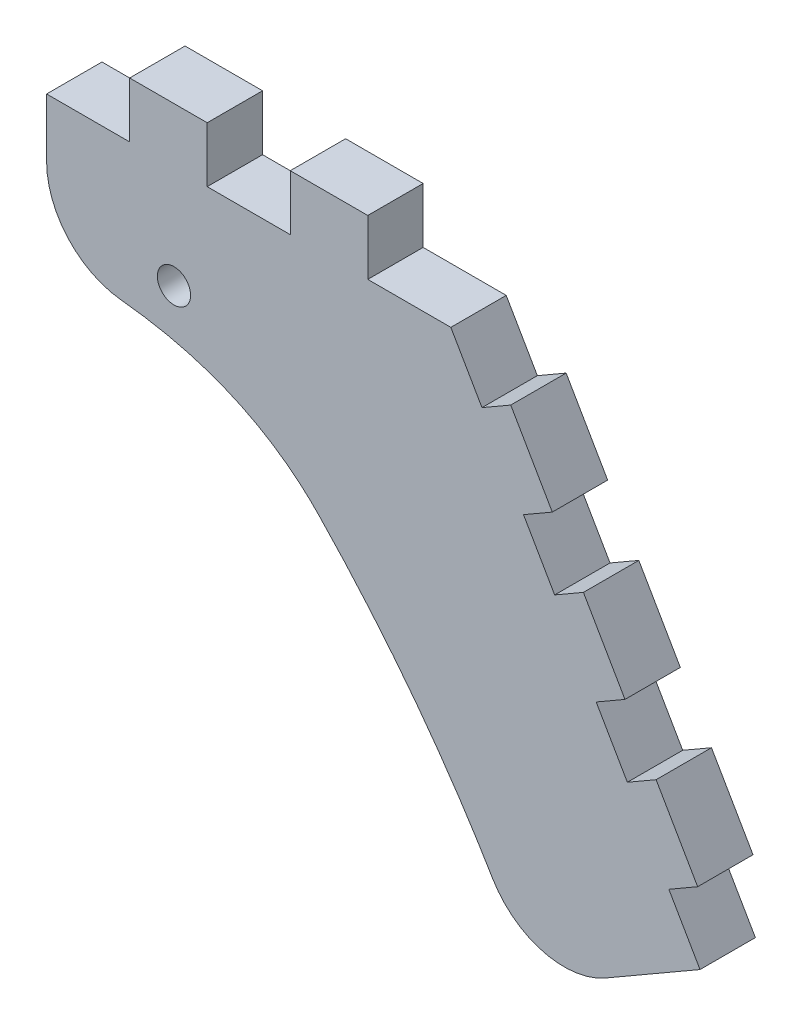
ISO-10303-21;
HEADER;
FILE_DESCRIPTION(('STEP AP214'),'2;1');
FILE_NAME('part.step','',(''),(''),'','','');
FILE_SCHEMA(('AUTOMOTIVE_DESIGN { 1 0 10303 214 1 1 1 1 }'));
ENDSEC;
DATA;
#1=APPLICATION_CONTEXT('core data for automotive mechanical design processes');
#2=APPLICATION_PROTOCOL_DEFINITION('international standard','automotive_design',2000,#1);
#3=PRODUCT_CONTEXT('',#1,'mechanical');
#4=PRODUCT('Part','Part','',(#3));
#5=PRODUCT_RELATED_PRODUCT_CATEGORY('part','',(#4));
#6=PRODUCT_DEFINITION_FORMATION('','',#4);
#7=PRODUCT_DEFINITION_CONTEXT('part definition',#1,'design');
#8=PRODUCT_DEFINITION('design','',#6,#7);
#9=PRODUCT_DEFINITION_SHAPE('','',#8);
#10=(LENGTH_UNIT() NAMED_UNIT(*) SI_UNIT(.MILLI.,.METRE.));
#11=(NAMED_UNIT(*) PLANE_ANGLE_UNIT() SI_UNIT($,.RADIAN.));
#12=(NAMED_UNIT(*) SI_UNIT($,.STERADIAN.) SOLID_ANGLE_UNIT());
#13=UNCERTAINTY_MEASURE_WITH_UNIT(LENGTH_MEASURE(1.E-05),#10,'distance_accuracy_value','');
#14=(GEOMETRIC_REPRESENTATION_CONTEXT(3) GLOBAL_UNCERTAINTY_ASSIGNED_CONTEXT((#13)) GLOBAL_UNIT_ASSIGNED_CONTEXT((#10,
#11,#12)) REPRESENTATION_CONTEXT('',''));
#15=CARTESIAN_POINT('',(0.,0.,0.));
#16=DIRECTION('',(0.,0.,1.));
#17=DIRECTION('',(1.,0.,0.));
#18=AXIS2_PLACEMENT_3D('',#15,#16,#17);
#19=CARTESIAN_POINT('',(26.0735053970116,-27.8403706532565,10.));
#20=DIRECTION('',(0.,0.,1.));
#21=DIRECTION('',(1.,0.,0.));
#22=AXIS2_PLACEMENT_3D('',#19,#20,#21);
#23=PLANE('',#22);
#24=CARTESIAN_POINT('',(49.1604769860692,-41.2912650883353,10.));
#25=CARTESIAN_POINT('',(64.8173033808278,-57.5696768542522,10.));
#26=CARTESIAN_POINT('',(77.6601813413193,-75.6200172716737,10.));
#27=CARTESIAN_POINT('',(87.6891108675446,-95.4422863405995,10.));
#28=B_SPLINE_CURVE_WITH_KNOTS('',3,(#24,#25,#26,#27),.UNSPECIFIED.,.F.,.F.,(4,4),(0.,1.),.UNSPECIFIED.);
#29=CARTESIAN_POINT('',(49.1604769860692,-41.2912650883353,10.));
#30=VERTEX_POINT('',#29);
#31=CARTESIAN_POINT('',(80.5569815722585,-82.440526329078,10.));
#32=VERTEX_POINT('',#31);
#33=EDGE_CURVE('E219',#30,#32,#28,.T.);
#34=ORIENTED_EDGE('',*,*,#33,.T.);
#35=CARTESIAN_POINT('',(93.4594473497084,-74.7902729436187,10.));
#36=DIRECTION('',(0.,0.,1.));
#37=DIRECTION('',(1.,0.,0.));
#38=AXIS2_PLACEMENT_3D('',#35,#36,#37);
#39=CIRCLE('',#38,15.);
#40=CARTESIAN_POINT('',(100.959447349708,-87.7806540003853,10.));
#41=VERTEX_POINT('',#40);
#42=EDGE_CURVE('E511',#32,#41,#39,.T.);
#43=ORIENTED_EDGE('',*,*,#42,.T.);
#44=DIRECTION('',(0.866025403784439,0.499999999999999,0.));
#45=VECTOR('',#44,1.);
#46=CARTESIAN_POINT('',(118.,-77.9422863405996,10.));
#47=LINE('',#46,#45);
#48=CARTESIAN_POINT('',(118.,-77.9422863405996,10.));
#49=VERTEX_POINT('',#48);
#50=EDGE_CURVE('E240',#41,#49,#47,.T.);
#51=ORIENTED_EDGE('',*,*,#50,.T.);
#52=DIRECTION('',(-0.499999999999998,0.86602540378444,0.));
#53=VECTOR('',#52,1.);
#54=CARTESIAN_POINT('',(112.375,-68.1995005480246,10.));
#55=LINE('',#54,#53);
#56=CARTESIAN_POINT('',(112.375,-68.1995005480246,10.));
#57=VERTEX_POINT('',#56);
#58=EDGE_CURVE('E242',#49,#57,#55,.T.);
#59=ORIENTED_EDGE('',*,*,#58,.T.);
#60=DIRECTION('',(0.866025403784439,0.499999999999999,0.));
#61=VECTOR('',#60,1.);
#62=CARTESIAN_POINT('',(117.571152422706,-65.1995005480249,10.));
#63=LINE('',#62,#61);
#64=CARTESIAN_POINT('',(117.571152422706,-65.1995005480249,10.));
#65=VERTEX_POINT('',#64);
#66=EDGE_CURVE('E391',#57,#65,#63,.T.);
#67=ORIENTED_EDGE('',*,*,#66,.T.);
#68=DIRECTION('',(-0.5,0.866025403784439,0.));
#69=VECTOR('',#68,1.);
#70=CARTESIAN_POINT('',(110.071152422706,-52.2091194912583,10.));
#71=LINE('',#70,#69);
#72=CARTESIAN_POINT('',(110.071152422706,-52.2091194912583,10.));
#73=VERTEX_POINT('',#72);
#74=EDGE_CURVE('E532',#65,#73,#71,.T.);
#75=ORIENTED_EDGE('',*,*,#74,.T.);
#76=DIRECTION('',(-0.866025403784439,-0.499999999999999,0.));
#77=VECTOR('',#76,1.);
#78=CARTESIAN_POINT('',(104.875,-55.209119491258,10.));
#79=LINE('',#78,#77);
#80=CARTESIAN_POINT('',(104.875,-55.209119491258,10.));
#81=VERTEX_POINT('',#80);
#82=EDGE_CURVE('E536',#73,#81,#79,.T.);
#83=ORIENTED_EDGE('',*,*,#82,.T.);
#84=DIRECTION('',(-0.499999999999999,0.866025403784439,0.));
#85=VECTOR('',#84,1.);
#86=CARTESIAN_POINT('',(99.2499999999999,-45.4663336986831,10.));
#87=LINE('',#86,#85);
#88=CARTESIAN_POINT('',(99.2499999999999,-45.4663336986831,10.));
#89=VERTEX_POINT('',#88);
#90=EDGE_CURVE('E538',#81,#89,#87,.T.);
#91=ORIENTED_EDGE('',*,*,#90,.T.);
#92=DIRECTION('',(0.86602540378444,0.499999999999998,0.));
#93=VECTOR('',#92,1.);
#94=CARTESIAN_POINT('',(104.446152422706,-42.4663336986834,10.));
#95=LINE('',#94,#93);
#96=CARTESIAN_POINT('',(104.446152422706,-42.4663336986834,10.));
#97=VERTEX_POINT('',#96);
#98=EDGE_CURVE('E540',#89,#97,#95,.T.);
#99=ORIENTED_EDGE('',*,*,#98,.T.);
#100=DIRECTION('',(-0.5,0.866025403784439,0.));
#101=VECTOR('',#100,1.);
#102=CARTESIAN_POINT('',(96.946152422706,-29.4759526419168,10.));
#103=LINE('',#102,#101);
#104=CARTESIAN_POINT('',(96.946152422706,-29.4759526419168,10.));
#105=VERTEX_POINT('',#104);
#106=EDGE_CURVE('E542',#97,#105,#103,.T.);
#107=ORIENTED_EDGE('',*,*,#106,.T.);
#108=DIRECTION('',(-0.866025403784439,-0.499999999999998,0.));
#109=VECTOR('',#108,1.);
#110=CARTESIAN_POINT('',(91.7499999999999,-32.4759526419165,10.));
#111=LINE('',#110,#109);
#112=CARTESIAN_POINT('',(91.7499999999999,-32.4759526419165,10.));
#113=VERTEX_POINT('',#112);
#114=EDGE_CURVE('E544',#105,#113,#111,.T.);
#115=ORIENTED_EDGE('',*,*,#114,.T.);
#116=DIRECTION('',(-0.499999999999999,0.866025403784439,0.));
#117=VECTOR('',#116,1.);
#118=CARTESIAN_POINT('',(86.125,-22.7331668493415,10.));
#119=LINE('',#118,#117);
#120=CARTESIAN_POINT('',(86.125,-22.7331668493415,10.));
#121=VERTEX_POINT('',#120);
#122=EDGE_CURVE('E546',#113,#121,#119,.T.);
#123=ORIENTED_EDGE('',*,*,#122,.T.);
#124=DIRECTION('',(0.866025403784439,0.5,0.));
#125=VECTOR('',#124,1.);
#126=CARTESIAN_POINT('',(91.321152422706,-19.7331668493419,10.));
#127=LINE('',#126,#125);
#128=CARTESIAN_POINT('',(91.321152422706,-19.7331668493419,10.));
#129=VERTEX_POINT('',#128);
#130=EDGE_CURVE('E548',#121,#129,#127,.T.);
#131=ORIENTED_EDGE('',*,*,#130,.T.);
#132=DIRECTION('',(-0.499999999999998,0.86602540378444,0.));
#133=VECTOR('',#132,1.);
#134=CARTESIAN_POINT('',(83.821152422706,-6.74278579257528,10.));
#135=LINE('',#134,#133);
#136=CARTESIAN_POINT('',(83.821152422706,-6.74278579257528,10.));
#137=VERTEX_POINT('',#136);
#138=EDGE_CURVE('E550',#129,#137,#135,.T.);
#139=ORIENTED_EDGE('',*,*,#138,.T.);
#140=DIRECTION('',(-0.866025403784439,-0.499999999999999,0.));
#141=VECTOR('',#140,1.);
#142=CARTESIAN_POINT('',(78.625,-9.74278579257494,10.));
#143=LINE('',#142,#141);
#144=CARTESIAN_POINT('',(78.625,-9.74278579257494,10.));
#145=VERTEX_POINT('',#144);
#146=EDGE_CURVE('E552',#137,#145,#143,.T.);
#147=ORIENTED_EDGE('',*,*,#146,.T.);
#148=DIRECTION('',(-0.499999999999999,0.866025403784439,0.));
#149=VECTOR('',#148,1.);
#150=CARTESIAN_POINT('',(73.,0.,10.));
#151=LINE('',#150,#149);
#152=CARTESIAN_POINT('',(73.,0.,10.));
#153=VERTEX_POINT('',#152);
#154=EDGE_CURVE('E554',#145,#153,#151,.T.);
#155=ORIENTED_EDGE('',*,*,#154,.T.);
#156=DIRECTION('',(-1.,0.,0.));
#157=VECTOR('',#156,1.);
#158=CARTESIAN_POINT('',(58.,0.,10.));
#159=LINE('',#158,#157);
#160=CARTESIAN_POINT('',(58.,0.,10.));
#161=VERTEX_POINT('',#160);
#162=EDGE_CURVE('E556',#153,#161,#159,.T.);
#163=ORIENTED_EDGE('',*,*,#162,.T.);
#164=DIRECTION('',(0.,1.,0.));
#165=VECTOR('',#164,1.);
#166=CARTESIAN_POINT('',(58.,10.,10.));
#167=LINE('',#166,#165);
#168=CARTESIAN_POINT('',(58.,10.,10.));
#169=VERTEX_POINT('',#168);
#170=EDGE_CURVE('E558',#161,#169,#167,.T.);
#171=ORIENTED_EDGE('',*,*,#170,.T.);
#172=DIRECTION('',(-1.,0.,0.));
#173=VECTOR('',#172,1.);
#174=CARTESIAN_POINT('',(44.,10.,10.));
#175=LINE('',#174,#173);
#176=CARTESIAN_POINT('',(44.,10.,10.));
#177=VERTEX_POINT('',#176);
#178=EDGE_CURVE('E560',#169,#177,#175,.T.);
#179=ORIENTED_EDGE('',*,*,#178,.T.);
#180=DIRECTION('',(0.,-1.,0.));
#181=VECTOR('',#180,1.);
#182=CARTESIAN_POINT('',(44.,0.,10.));
#183=LINE('',#182,#181);
#184=CARTESIAN_POINT('',(44.,0.,10.));
#185=VERTEX_POINT('',#184);
#186=EDGE_CURVE('E562',#177,#185,#183,.T.);
#187=ORIENTED_EDGE('',*,*,#186,.T.);
#188=DIRECTION('',(-1.,0.,0.));
#189=VECTOR('',#188,1.);
#190=CARTESIAN_POINT('',(29.,0.,10.));
#191=LINE('',#190,#189);
#192=CARTESIAN_POINT('',(29.,0.,10.));
#193=VERTEX_POINT('',#192);
#194=EDGE_CURVE('E564',#185,#193,#191,.T.);
#195=ORIENTED_EDGE('',*,*,#194,.T.);
#196=DIRECTION('',(0.,1.,0.));
#197=VECTOR('',#196,1.);
#198=CARTESIAN_POINT('',(29.,10.,10.));
#199=LINE('',#198,#197);
#200=CARTESIAN_POINT('',(29.,10.,10.));
#201=VERTEX_POINT('',#200);
#202=EDGE_CURVE('E566',#193,#201,#199,.T.);
#203=ORIENTED_EDGE('',*,*,#202,.T.);
#204=DIRECTION('',(-1.,0.,0.));
#205=VECTOR('',#204,1.);
#206=CARTESIAN_POINT('',(15.,10.,10.));
#207=LINE('',#206,#205);
#208=CARTESIAN_POINT('',(15.,10.,10.));
#209=VERTEX_POINT('',#208);
#210=EDGE_CURVE('E568',#201,#209,#207,.T.);
#211=ORIENTED_EDGE('',*,*,#210,.T.);
#212=DIRECTION('',(0.,-1.,0.));
#213=VECTOR('',#212,1.);
#214=CARTESIAN_POINT('',(15.,0.,10.));
#215=LINE('',#214,#213);
#216=CARTESIAN_POINT('',(15.,0.,10.));
#217=VERTEX_POINT('',#216);
#218=EDGE_CURVE('E570',#209,#217,#215,.T.);
#219=ORIENTED_EDGE('',*,*,#218,.T.);
#220=DIRECTION('',(-1.,0.,0.));
#221=VECTOR('',#220,1.);
#222=CARTESIAN_POINT('',(0.,0.,10.));
#223=LINE('',#222,#221);
#224=CARTESIAN_POINT('',(0.,0.,10.));
#225=VERTEX_POINT('',#224);
#226=EDGE_CURVE('E444',#217,#225,#223,.T.);
#227=ORIENTED_EDGE('',*,*,#226,.T.);
#228=DIRECTION('',(0.,-1.,0.));
#229=VECTOR('',#228,1.);
#230=CARTESIAN_POINT('',(0.,0.,10.));
#231=LINE('',#230,#229);
#232=CARTESIAN_POINT('',(0.,-10.5712182716982,10.));
#233=VERTEX_POINT('',#232);
#234=EDGE_CURVE('E224',#225,#233,#231,.T.);
#235=ORIENTED_EDGE('',*,*,#234,.T.);
#236=CARTESIAN_POINT('',(15.,-10.5712182716982,10.));
#237=DIRECTION('',(0.,0.,1.));
#238=DIRECTION('',(1.,0.,0.));
#239=AXIS2_PLACEMENT_3D('',#236,#237,#238);
#240=CIRCLE('',#239,15.);
#241=CARTESIAN_POINT('',(13.4616697727823,-25.4921277651584,10.));
#242=VERTEX_POINT('',#241);
#243=EDGE_CURVE('E47',#233,#242,#240,.T.);
#244=ORIENTED_EDGE('',*,*,#243,.T.);
#245=CARTESIAN_POINT('',(0.,-25.,10.));
#246=CARTESIAN_POINT('',(17.2425344672211,-24.6395737065002,10.));
#247=CARTESIAN_POINT('',(35.8999875961201,-27.5043263394054,10.));
#248=CARTESIAN_POINT('',(49.1604769860692,-41.2912650883353,10.));
#249=B_SPLINE_CURVE_WITH_KNOTS('',3,(#245,#246,#247,#248),.UNSPECIFIED.,.F.,.F.,(4,4),(0.,1.),.UNSPECIFIED.);
#250=EDGE_CURVE('E215',#242,#30,#249,.T.);
#251=ORIENTED_EDGE('',*,*,#250,.T.);
#252=EDGE_LOOP('',(#34,#43,#51,#59,#67,#75,#83,#91,#99,#107,#115,#123,#131,#139,#147,#155,#163,
#171,#179,#187,#195,#203,#211,#219,#227,#235,#244,#251));
#253=FACE_BOUND('',#252,.T.);
#254=CARTESIAN_POINT('',(23.,-18.5,10.));
#255=DIRECTION('',(0.,0.,1.));
#256=DIRECTION('',(1.,0.,0.));
#257=AXIS2_PLACEMENT_3D('',#254,#255,#256);
#258=CIRCLE('',#257,3.);
#259=CARTESIAN_POINT('',(26.,-18.5,10.));
#260=VERTEX_POINT('',#259);
#261=EDGE_CURVE('E517',#260,#260,#258,.T.);
#262=ORIENTED_EDGE('',*,*,#261,.F.);
#263=EDGE_LOOP('',(#262));
#264=FACE_BOUND('',#263,.T.);
#265=ADVANCED_FACE('F32',(#253,#264),#23,.T.);
#266=CARTESIAN_POINT('',(26.0735053970116,-27.8403706532565,0.));
#267=DIRECTION('',(0.,0.,1.));
#268=DIRECTION('',(1.,0.,0.));
#269=AXIS2_PLACEMENT_3D('',#266,#267,#268);
#270=PLANE('',#269);
#271=DIRECTION('',(0.866025403784439,0.499999999999999,0.));
#272=VECTOR('',#271,1.);
#273=CARTESIAN_POINT('',(118.,-77.9422863405996,0.));
#274=LINE('',#273,#272);
#275=CARTESIAN_POINT('',(100.959447349708,-87.7806540003853,0.));
#276=VERTEX_POINT('',#275);
#277=CARTESIAN_POINT('',(118.,-77.9422863405996,0.));
#278=VERTEX_POINT('',#277);
#279=EDGE_CURVE('E387',#276,#278,#274,.T.);
#280=ORIENTED_EDGE('',*,*,#279,.F.);
#281=CARTESIAN_POINT('',(93.4594473497084,-74.7902729436187,0.));
#282=DIRECTION('',(0.,0.,1.));
#283=DIRECTION('',(1.,0.,0.));
#284=AXIS2_PLACEMENT_3D('',#281,#282,#283);
#285=CIRCLE('',#284,15.);
#286=CARTESIAN_POINT('',(80.5569815722585,-82.440526329078,0.));
#287=VERTEX_POINT('',#286);
#288=EDGE_CURVE('E507',#276,#287,#285,.F.);
#289=ORIENTED_EDGE('',*,*,#288,.T.);
#290=CARTESIAN_POINT('',(49.1604769860692,-41.2912650883353,0.));
#291=CARTESIAN_POINT('',(64.8173033808278,-57.5696768542522,0.));
#292=CARTESIAN_POINT('',(77.6601813413193,-75.6200172716737,0.));
#293=CARTESIAN_POINT('',(87.6891108675446,-95.4422863405995,0.));
#294=B_SPLINE_CURVE_WITH_KNOTS('',3,(#290,#291,#292,#293),.UNSPECIFIED.,.F.,.F.,(4,4),(0.,1.),.UNSPECIFIED.);
#295=CARTESIAN_POINT('',(49.1604769860692,-41.2912650883353,0.));
#296=VERTEX_POINT('',#295);
#297=EDGE_CURVE('E513',#296,#287,#294,.T.);
#298=ORIENTED_EDGE('',*,*,#297,.F.);
#299=CARTESIAN_POINT('',(0.,-25.,0.));
#300=CARTESIAN_POINT('',(17.2425344672211,-24.6395737065002,0.));
#301=CARTESIAN_POINT('',(35.8999875961201,-27.5043263394054,0.));
#302=CARTESIAN_POINT('',(49.1604769860692,-41.2912650883353,0.));
#303=B_SPLINE_CURVE_WITH_KNOTS('',3,(#299,#300,#301,#302),.UNSPECIFIED.,.F.,.F.,(4,4),(0.,1.),.UNSPECIFIED.);
#304=CARTESIAN_POINT('',(13.4616697727823,-25.4921277651584,0.));
#305=VERTEX_POINT('',#304);
#306=EDGE_CURVE('E230',#305,#296,#303,.T.);
#307=ORIENTED_EDGE('',*,*,#306,.F.);
#308=CARTESIAN_POINT('',(15.,-10.5712182716982,0.));
#309=DIRECTION('',(0.,0.,1.));
#310=DIRECTION('',(1.,0.,0.));
#311=AXIS2_PLACEMENT_3D('',#308,#309,#310);
#312=CIRCLE('',#311,15.);
#313=CARTESIAN_POINT('',(0.,-10.5712182716982,0.));
#314=VERTEX_POINT('',#313);
#315=EDGE_CURVE('E505',#305,#314,#312,.F.);
#316=ORIENTED_EDGE('',*,*,#315,.T.);
#317=DIRECTION('',(0.,-1.,0.));
#318=VECTOR('',#317,1.);
#319=CARTESIAN_POINT('',(0.,0.,0.));
#320=LINE('',#319,#318);
#321=CARTESIAN_POINT('',(0.,0.,0.));
#322=VERTEX_POINT('',#321);
#323=EDGE_CURVE('E514',#322,#314,#320,.T.);
#324=ORIENTED_EDGE('',*,*,#323,.F.);
#325=DIRECTION('',(-1.,0.,0.));
#326=VECTOR('',#325,1.);
#327=CARTESIAN_POINT('',(0.,0.,0.));
#328=LINE('',#327,#326);
#329=CARTESIAN_POINT('',(15.,0.,0.));
#330=VERTEX_POINT('',#329);
#331=EDGE_CURVE('E438',#330,#322,#328,.T.);
#332=ORIENTED_EDGE('',*,*,#331,.F.);
#333=DIRECTION('',(0.,-1.,0.));
#334=VECTOR('',#333,1.);
#335=CARTESIAN_POINT('',(15.,0.,0.));
#336=LINE('',#335,#334);
#337=CARTESIAN_POINT('',(15.,10.,0.));
#338=VERTEX_POINT('',#337);
#339=EDGE_CURVE('E436',#338,#330,#336,.T.);
#340=ORIENTED_EDGE('',*,*,#339,.F.);
#341=DIRECTION('',(-1.,0.,0.));
#342=VECTOR('',#341,1.);
#343=CARTESIAN_POINT('',(15.,10.,0.));
#344=LINE('',#343,#342);
#345=CARTESIAN_POINT('',(29.,10.,0.));
#346=VERTEX_POINT('',#345);
#347=EDGE_CURVE('E434',#346,#338,#344,.T.);
#348=ORIENTED_EDGE('',*,*,#347,.F.);
#349=DIRECTION('',(0.,1.,0.));
#350=VECTOR('',#349,1.);
#351=CARTESIAN_POINT('',(29.,10.,0.));
#352=LINE('',#351,#350);
#353=CARTESIAN_POINT('',(29.,0.,0.));
#354=VERTEX_POINT('',#353);
#355=EDGE_CURVE('E432',#354,#346,#352,.T.);
#356=ORIENTED_EDGE('',*,*,#355,.F.);
#357=DIRECTION('',(-1.,0.,0.));
#358=VECTOR('',#357,1.);
#359=CARTESIAN_POINT('',(29.,0.,0.));
#360=LINE('',#359,#358);
#361=CARTESIAN_POINT('',(44.,0.,0.));
#362=VERTEX_POINT('',#361);
#363=EDGE_CURVE('E430',#362,#354,#360,.T.);
#364=ORIENTED_EDGE('',*,*,#363,.F.);
#365=DIRECTION('',(0.,-1.,0.));
#366=VECTOR('',#365,1.);
#367=CARTESIAN_POINT('',(44.,0.,0.));
#368=LINE('',#367,#366);
#369=CARTESIAN_POINT('',(44.,10.,0.));
#370=VERTEX_POINT('',#369);
#371=EDGE_CURVE('E428',#370,#362,#368,.T.);
#372=ORIENTED_EDGE('',*,*,#371,.F.);
#373=DIRECTION('',(-1.,0.,0.));
#374=VECTOR('',#373,1.);
#375=CARTESIAN_POINT('',(44.,10.,0.));
#376=LINE('',#375,#374);
#377=CARTESIAN_POINT('',(58.,10.,0.));
#378=VERTEX_POINT('',#377);
#379=EDGE_CURVE('E426',#378,#370,#376,.T.);
#380=ORIENTED_EDGE('',*,*,#379,.F.);
#381=DIRECTION('',(0.,1.,0.));
#382=VECTOR('',#381,1.);
#383=CARTESIAN_POINT('',(58.,10.,0.));
#384=LINE('',#383,#382);
#385=CARTESIAN_POINT('',(58.,0.,0.));
#386=VERTEX_POINT('',#385);
#387=EDGE_CURVE('E424',#386,#378,#384,.T.);
#388=ORIENTED_EDGE('',*,*,#387,.F.);
#389=DIRECTION('',(-1.,0.,0.));
#390=VECTOR('',#389,1.);
#391=CARTESIAN_POINT('',(58.,0.,0.));
#392=LINE('',#391,#390);
#393=CARTESIAN_POINT('',(73.,0.,0.));
#394=VERTEX_POINT('',#393);
#395=EDGE_CURVE('E422',#394,#386,#392,.T.);
#396=ORIENTED_EDGE('',*,*,#395,.F.);
#397=DIRECTION('',(-0.499999999999999,0.866025403784439,0.));
#398=VECTOR('',#397,1.);
#399=CARTESIAN_POINT('',(73.,0.,0.));
#400=LINE('',#399,#398);
#401=CARTESIAN_POINT('',(78.625,-9.74278579257494,0.));
#402=VERTEX_POINT('',#401);
#403=EDGE_CURVE('E420',#402,#394,#400,.T.);
#404=ORIENTED_EDGE('',*,*,#403,.F.);
#405=DIRECTION('',(-0.866025403784439,-0.499999999999999,0.));
#406=VECTOR('',#405,1.);
#407=CARTESIAN_POINT('',(78.625,-9.74278579257494,0.));
#408=LINE('',#407,#406);
#409=CARTESIAN_POINT('',(83.821152422706,-6.74278579257528,0.));
#410=VERTEX_POINT('',#409);
#411=EDGE_CURVE('E418',#410,#402,#408,.T.);
#412=ORIENTED_EDGE('',*,*,#411,.F.);
#413=DIRECTION('',(-0.499999999999998,0.86602540378444,0.));
#414=VECTOR('',#413,1.);
#415=CARTESIAN_POINT('',(83.821152422706,-6.74278579257528,0.));
#416=LINE('',#415,#414);
#417=CARTESIAN_POINT('',(91.321152422706,-19.7331668493419,0.));
#418=VERTEX_POINT('',#417);
#419=EDGE_CURVE('E416',#418,#410,#416,.T.);
#420=ORIENTED_EDGE('',*,*,#419,.F.);
#421=DIRECTION('',(0.866025403784439,0.5,0.));
#422=VECTOR('',#421,1.);
#423=CARTESIAN_POINT('',(91.321152422706,-19.7331668493419,0.));
#424=LINE('',#423,#422);
#425=CARTESIAN_POINT('',(86.125,-22.7331668493415,0.));
#426=VERTEX_POINT('',#425);
#427=EDGE_CURVE('E414',#426,#418,#424,.T.);
#428=ORIENTED_EDGE('',*,*,#427,.F.);
#429=DIRECTION('',(-0.499999999999999,0.866025403784439,0.));
#430=VECTOR('',#429,1.);
#431=CARTESIAN_POINT('',(86.125,-22.7331668493415,0.));
#432=LINE('',#431,#430);
#433=CARTESIAN_POINT('',(91.7499999999999,-32.4759526419165,0.));
#434=VERTEX_POINT('',#433);
#435=EDGE_CURVE('E412',#434,#426,#432,.T.);
#436=ORIENTED_EDGE('',*,*,#435,.F.);
#437=DIRECTION('',(-0.866025403784439,-0.499999999999998,0.));
#438=VECTOR('',#437,1.);
#439=CARTESIAN_POINT('',(91.7499999999999,-32.4759526419165,0.));
#440=LINE('',#439,#438);
#441=CARTESIAN_POINT('',(96.946152422706,-29.4759526419168,0.));
#442=VERTEX_POINT('',#441);
#443=EDGE_CURVE('E410',#442,#434,#440,.T.);
#444=ORIENTED_EDGE('',*,*,#443,.F.);
#445=DIRECTION('',(-0.5,0.866025403784439,0.));
#446=VECTOR('',#445,1.);
#447=CARTESIAN_POINT('',(96.946152422706,-29.4759526419168,0.));
#448=LINE('',#447,#446);
#449=CARTESIAN_POINT('',(104.446152422706,-42.4663336986834,0.));
#450=VERTEX_POINT('',#449);
#451=EDGE_CURVE('E408',#450,#442,#448,.T.);
#452=ORIENTED_EDGE('',*,*,#451,.F.);
#453=DIRECTION('',(0.86602540378444,0.499999999999998,0.));
#454=VECTOR('',#453,1.);
#455=CARTESIAN_POINT('',(104.446152422706,-42.4663336986834,0.));
#456=LINE('',#455,#454);
#457=CARTESIAN_POINT('',(99.2499999999999,-45.4663336986831,0.));
#458=VERTEX_POINT('',#457);
#459=EDGE_CURVE('E406',#458,#450,#456,.T.);
#460=ORIENTED_EDGE('',*,*,#459,.F.);
#461=DIRECTION('',(-0.499999999999999,0.866025403784439,0.));
#462=VECTOR('',#461,1.);
#463=CARTESIAN_POINT('',(99.2499999999999,-45.4663336986831,0.));
#464=LINE('',#463,#462);
#465=CARTESIAN_POINT('',(104.875,-55.209119491258,0.));
#466=VERTEX_POINT('',#465);
#467=EDGE_CURVE('E404',#466,#458,#464,.T.);
#468=ORIENTED_EDGE('',*,*,#467,.F.);
#469=DIRECTION('',(-0.866025403784439,-0.499999999999999,0.));
#470=VECTOR('',#469,1.);
#471=CARTESIAN_POINT('',(104.875,-55.209119491258,0.));
#472=LINE('',#471,#470);
#473=CARTESIAN_POINT('',(110.071152422706,-52.2091194912583,0.));
#474=VERTEX_POINT('',#473);
#475=EDGE_CURVE('E399',#474,#466,#472,.T.);
#476=ORIENTED_EDGE('',*,*,#475,.F.);
#477=DIRECTION('',(-0.5,0.866025403784439,0.));
#478=VECTOR('',#477,1.);
#479=CARTESIAN_POINT('',(110.071152422706,-52.2091194912583,0.));
#480=LINE('',#479,#478);
#481=CARTESIAN_POINT('',(117.571152422706,-65.1995005480249,0.));
#482=VERTEX_POINT('',#481);
#483=EDGE_CURVE('E397',#482,#474,#480,.T.);
#484=ORIENTED_EDGE('',*,*,#483,.F.);
#485=DIRECTION('',(0.866025403784439,0.499999999999999,0.));
#486=VECTOR('',#485,1.);
#487=CARTESIAN_POINT('',(117.571152422706,-65.1995005480249,0.));
#488=LINE('',#487,#486);
#489=CARTESIAN_POINT('',(112.375,-68.1995005480246,0.));
#490=VERTEX_POINT('',#489);
#491=EDGE_CURVE('E386',#490,#482,#488,.T.);
#492=ORIENTED_EDGE('',*,*,#491,.F.);
#493=DIRECTION('',(-0.499999999999998,0.86602540378444,0.));
#494=VECTOR('',#493,1.);
#495=CARTESIAN_POINT('',(112.375,-68.1995005480246,0.));
#496=LINE('',#495,#494);
#497=EDGE_CURVE('E378',#278,#490,#496,.T.);
#498=ORIENTED_EDGE('',*,*,#497,.F.);
#499=EDGE_LOOP('',(#280,#289,#298,#307,#316,#324,#332,#340,#348,#356,#364,#372,#380,#388,#396,
#404,#412,#420,#428,#436,#444,#452,#460,#468,#476,#484,#492,#498));
#500=FACE_BOUND('',#499,.T.);
#501=CARTESIAN_POINT('',(23.,-18.5,0.));
#502=DIRECTION('',(0.,0.,1.));
#503=DIRECTION('',(1.,0.,0.));
#504=AXIS2_PLACEMENT_3D('',#501,#502,#503);
#505=CIRCLE('',#504,3.);
#506=CARTESIAN_POINT('',(26.,-18.5,0.));
#507=VERTEX_POINT('',#506);
#508=EDGE_CURVE('E577',#507,#507,#505,.T.);
#509=ORIENTED_EDGE('',*,*,#508,.T.);
#510=EDGE_LOOP('',(#509));
#511=FACE_BOUND('',#510,.T.);
#512=ADVANCED_FACE('F265',(#500,#511),#270,.F.);
#513=CARTESIAN_POINT('',(0.,0.,10.));
#514=DIRECTION('',(1.,0.,0.));
#515=DIRECTION('',(0.,1.,0.));
#516=AXIS2_PLACEMENT_3D('',#513,#514,#515);
#517=PLANE('',#516);
#518=ORIENTED_EDGE('',*,*,#323,.T.);
#519=DIRECTION('',(0.,0.,-1.));
#520=VECTOR('',#519,1.);
#521=CARTESIAN_POINT('',(0.,-10.5712182716982,10.));
#522=LINE('',#521,#520);
#523=EDGE_CURVE('E11',#314,#233,#522,.F.);
#524=ORIENTED_EDGE('',*,*,#523,.T.);
#525=ORIENTED_EDGE('',*,*,#234,.F.);
#526=DIRECTION('',(0.,0.,-1.));
#527=VECTOR('',#526,1.);
#528=CARTESIAN_POINT('',(0.,0.,10.));
#529=LINE('',#528,#527);
#530=EDGE_CURVE('E440',#225,#322,#529,.T.);
#531=ORIENTED_EDGE('',*,*,#530,.T.);
#532=EDGE_LOOP('',(#518,#524,#525,#531));
#533=FACE_BOUND('',#532,.T.);
#534=ADVANCED_FACE('F263',(#533),#517,.F.);
#535=DIRECTION('',(0.,0.,-1.));
#536=VECTOR('',#535,1.);
#537=SURFACE_OF_LINEAR_EXTRUSION('',#249,#536);
#538=ORIENTED_EDGE('',*,*,#250,.F.);
#539=DIRECTION('',(0.,0.,-1.));
#540=VECTOR('',#539,1.);
#541=CARTESIAN_POINT('',(13.4616697727821,-25.4921277651583,10.));
#542=LINE('',#541,#540);
#543=EDGE_CURVE('E40',#242,#305,#542,.T.);
#544=ORIENTED_EDGE('',*,*,#543,.T.);
#545=ORIENTED_EDGE('',*,*,#306,.T.);
#546=DIRECTION('',(0.,0.,-1.));
#547=VECTOR('',#546,1.);
#548=CARTESIAN_POINT('',(49.1604769860692,-41.2912650883353,10.));
#549=LINE('',#548,#547);
#550=EDGE_CURVE('E227',#30,#296,#549,.T.);
#551=ORIENTED_EDGE('',*,*,#550,.F.);
#552=EDGE_LOOP('',(#538,#544,#545,#551));
#553=FACE_BOUND('',#552,.T.);
#554=ADVANCED_FACE('F228',(#553),#537,.F.);
#555=DIRECTION('',(0.,0.,-1.));
#556=VECTOR('',#555,1.);
#557=SURFACE_OF_LINEAR_EXTRUSION('',#28,#556);
#558=ORIENTED_EDGE('',*,*,#297,.T.);
#559=DIRECTION('',(0.,0.,-1.));
#560=VECTOR('',#559,1.);
#561=CARTESIAN_POINT('',(80.5569815722585,-82.4405263290781,0.));
#562=LINE('',#561,#560);
#563=EDGE_CURVE('E239',#287,#32,#562,.F.);
#564=ORIENTED_EDGE('',*,*,#563,.T.);
#565=ORIENTED_EDGE('',*,*,#33,.F.);
#566=ORIENTED_EDGE('',*,*,#550,.T.);
#567=EDGE_LOOP('',(#558,#564,#565,#566));
#568=FACE_BOUND('',#567,.T.);
#569=ADVANCED_FACE('F237',(#568),#557,.F.);
#570=CARTESIAN_POINT('',(118.,-77.9422863405996,10.));
#571=DIRECTION('',(-0.499999999999999,0.866025403784439,0.));
#572=DIRECTION('',(-0.866025403784439,-0.499999999999999,0.));
#573=AXIS2_PLACEMENT_3D('',#570,#571,#572);
#574=PLANE('',#573);
#575=ORIENTED_EDGE('',*,*,#50,.F.);
#576=DIRECTION('',(0.,0.,-1.));
#577=VECTOR('',#576,1.);
#578=CARTESIAN_POINT('',(100.959447349708,-87.7806540003853,10.));
#579=LINE('',#578,#577);
#580=EDGE_CURVE('E234',#41,#276,#579,.T.);
#581=ORIENTED_EDGE('',*,*,#580,.T.);
#582=ORIENTED_EDGE('',*,*,#279,.T.);
#583=DIRECTION('',(0.,0.,-1.));
#584=VECTOR('',#583,1.);
#585=CARTESIAN_POINT('',(118.,-77.9422863405996,10.));
#586=LINE('',#585,#584);
#587=EDGE_CURVE('E235',#49,#278,#586,.T.);
#588=ORIENTED_EDGE('',*,*,#587,.F.);
#589=EDGE_LOOP('',(#575,#581,#582,#588));
#590=FACE_BOUND('',#589,.T.);
#591=ADVANCED_FACE('F259',(#590),#574,.F.);
#592=CARTESIAN_POINT('',(112.375,-68.1995005480246,10.));
#593=DIRECTION('',(-0.86602540378444,-0.499999999999998,0.));
#594=DIRECTION('',(0.499999999999998,-0.86602540378444,0.));
#595=AXIS2_PLACEMENT_3D('',#592,#593,#594);
#596=PLANE('',#595);
#597=ORIENTED_EDGE('',*,*,#497,.T.);
#598=DIRECTION('',(0.,0.,-1.));
#599=VECTOR('',#598,1.);
#600=CARTESIAN_POINT('',(112.375,-68.1995005480246,10.));
#601=LINE('',#600,#599);
#602=EDGE_CURVE('E381',#57,#490,#601,.T.);
#603=ORIENTED_EDGE('',*,*,#602,.F.);
#604=ORIENTED_EDGE('',*,*,#58,.F.);
#605=ORIENTED_EDGE('',*,*,#587,.T.);
#606=EDGE_LOOP('',(#597,#603,#604,#605));
#607=FACE_BOUND('',#606,.T.);
#608=ADVANCED_FACE('F367',(#607),#596,.F.);
#609=CARTESIAN_POINT('',(117.571152422706,-65.1995005480249,10.));
#610=DIRECTION('',(-0.499999999999999,0.866025403784439,0.));
#611=DIRECTION('',(-0.86602540378444,-0.499999999999999,0.));
#612=AXIS2_PLACEMENT_3D('',#609,#610,#611);
#613=PLANE('',#612);
#614=ORIENTED_EDGE('',*,*,#491,.T.);
#615=DIRECTION('',(0.,0.,-1.));
#616=VECTOR('',#615,1.);
#617=CARTESIAN_POINT('',(117.571152422706,-65.1995005480249,10.));
#618=LINE('',#617,#616);
#619=EDGE_CURVE('E392',#65,#482,#618,.T.);
#620=ORIENTED_EDGE('',*,*,#619,.F.);
#621=ORIENTED_EDGE('',*,*,#66,.F.);
#622=ORIENTED_EDGE('',*,*,#602,.T.);
#623=EDGE_LOOP('',(#614,#620,#621,#622));
#624=FACE_BOUND('',#623,.T.);
#625=ADVANCED_FACE('F364',(#624),#613,.F.);
#626=CARTESIAN_POINT('',(110.071152422706,-52.2091194912583,10.));
#627=DIRECTION('',(-0.866025403784439,-0.5,0.));
#628=DIRECTION('',(0.5,-0.866025403784439,0.));
#629=AXIS2_PLACEMENT_3D('',#626,#627,#628);
#630=PLANE('',#629);
#631=ORIENTED_EDGE('',*,*,#483,.T.);
#632=DIRECTION('',(0.,0.,-1.));
#633=VECTOR('',#632,1.);
#634=CARTESIAN_POINT('',(110.071152422706,-52.2091194912583,10.));
#635=LINE('',#634,#633);
#636=EDGE_CURVE('E498',#73,#474,#635,.T.);
#637=ORIENTED_EDGE('',*,*,#636,.F.);
#638=ORIENTED_EDGE('',*,*,#74,.F.);
#639=ORIENTED_EDGE('',*,*,#619,.T.);
#640=EDGE_LOOP('',(#631,#637,#638,#639));
#641=FACE_BOUND('',#640,.T.);
#642=ADVANCED_FACE('F360',(#641),#630,.F.);
#643=CARTESIAN_POINT('',(104.875,-55.209119491258,10.));
#644=DIRECTION('',(0.499999999999999,-0.866025403784439,0.));
#645=DIRECTION('',(0.866025403784439,0.499999999999999,0.));
#646=AXIS2_PLACEMENT_3D('',#643,#644,#645);
#647=PLANE('',#646);
#648=ORIENTED_EDGE('',*,*,#475,.T.);
#649=DIRECTION('',(0.,0.,-1.));
#650=VECTOR('',#649,1.);
#651=CARTESIAN_POINT('',(104.875,-55.209119491258,10.));
#652=LINE('',#651,#650);
#653=EDGE_CURVE('E495',#81,#466,#652,.T.);
#654=ORIENTED_EDGE('',*,*,#653,.F.);
#655=ORIENTED_EDGE('',*,*,#82,.F.);
#656=ORIENTED_EDGE('',*,*,#636,.T.);
#657=EDGE_LOOP('',(#648,#654,#655,#656));
#658=FACE_BOUND('',#657,.T.);
#659=ADVANCED_FACE('F356',(#658),#647,.F.);
#660=CARTESIAN_POINT('',(99.2499999999999,-45.4663336986831,10.));
#661=DIRECTION('',(-0.866025403784439,-0.499999999999999,0.));
#662=DIRECTION('',(0.499999999999999,-0.866025403784439,0.));
#663=AXIS2_PLACEMENT_3D('',#660,#661,#662);
#664=PLANE('',#663);
#665=ORIENTED_EDGE('',*,*,#467,.T.);
#666=DIRECTION('',(0.,0.,-1.));
#667=VECTOR('',#666,1.);
#668=CARTESIAN_POINT('',(99.2499999999999,-45.4663336986831,10.));
#669=LINE('',#668,#667);
#670=EDGE_CURVE('E492',#89,#458,#669,.T.);
#671=ORIENTED_EDGE('',*,*,#670,.F.);
#672=ORIENTED_EDGE('',*,*,#90,.F.);
#673=ORIENTED_EDGE('',*,*,#653,.T.);
#674=EDGE_LOOP('',(#665,#671,#672,#673));
#675=FACE_BOUND('',#674,.T.);
#676=ADVANCED_FACE('F352',(#675),#664,.F.);
#677=CARTESIAN_POINT('',(104.446152422706,-42.4663336986834,10.));
#678=DIRECTION('',(-0.499999999999998,0.86602540378444,0.));
#679=DIRECTION('',(-0.86602540378444,-0.499999999999998,0.));
#680=AXIS2_PLACEMENT_3D('',#677,#678,#679);
#681=PLANE('',#680);
#682=ORIENTED_EDGE('',*,*,#459,.T.);
#683=DIRECTION('',(0.,0.,-1.));
#684=VECTOR('',#683,1.);
#685=CARTESIAN_POINT('',(104.446152422706,-42.4663336986834,10.));
#686=LINE('',#685,#684);
#687=EDGE_CURVE('E489',#97,#450,#686,.T.);
#688=ORIENTED_EDGE('',*,*,#687,.F.);
#689=ORIENTED_EDGE('',*,*,#98,.F.);
#690=ORIENTED_EDGE('',*,*,#670,.T.);
#691=EDGE_LOOP('',(#682,#688,#689,#690));
#692=FACE_BOUND('',#691,.T.);
#693=ADVANCED_FACE('F348',(#692),#681,.F.);
#694=CARTESIAN_POINT('',(96.946152422706,-29.4759526419168,10.));
#695=DIRECTION('',(-0.866025403784439,-0.5,0.));
#696=DIRECTION('',(0.5,-0.866025403784439,0.));
#697=AXIS2_PLACEMENT_3D('',#694,#695,#696);
#698=PLANE('',#697);
#699=ORIENTED_EDGE('',*,*,#451,.T.);
#700=DIRECTION('',(0.,0.,-1.));
#701=VECTOR('',#700,1.);
#702=CARTESIAN_POINT('',(96.946152422706,-29.4759526419168,10.));
#703=LINE('',#702,#701);
#704=EDGE_CURVE('E486',#105,#442,#703,.T.);
#705=ORIENTED_EDGE('',*,*,#704,.F.);
#706=ORIENTED_EDGE('',*,*,#106,.F.);
#707=ORIENTED_EDGE('',*,*,#687,.T.);
#708=EDGE_LOOP('',(#699,#705,#706,#707));
#709=FACE_BOUND('',#708,.T.);
#710=ADVANCED_FACE('F344',(#709),#698,.F.);
#711=CARTESIAN_POINT('',(91.7499999999999,-32.4759526419165,10.));
#712=DIRECTION('',(0.499999999999998,-0.866025403784439,0.));
#713=DIRECTION('',(0.86602540378444,0.499999999999998,0.));
#714=AXIS2_PLACEMENT_3D('',#711,#712,#713);
#715=PLANE('',#714);
#716=ORIENTED_EDGE('',*,*,#443,.T.);
#717=DIRECTION('',(0.,0.,-1.));
#718=VECTOR('',#717,1.);
#719=CARTESIAN_POINT('',(91.7499999999999,-32.4759526419165,10.));
#720=LINE('',#719,#718);
#721=EDGE_CURVE('E483',#113,#434,#720,.T.);
#722=ORIENTED_EDGE('',*,*,#721,.F.);
#723=ORIENTED_EDGE('',*,*,#114,.F.);
#724=ORIENTED_EDGE('',*,*,#704,.T.);
#725=EDGE_LOOP('',(#716,#722,#723,#724));
#726=FACE_BOUND('',#725,.T.);
#727=ADVANCED_FACE('F340',(#726),#715,.F.);
#728=CARTESIAN_POINT('',(86.125,-22.7331668493415,10.));
#729=DIRECTION('',(-0.866025403784439,-0.5,0.));
#730=DIRECTION('',(0.5,-0.866025403784439,0.));
#731=AXIS2_PLACEMENT_3D('',#728,#729,#730);
#732=PLANE('',#731);
#733=ORIENTED_EDGE('',*,*,#435,.T.);
#734=DIRECTION('',(0.,0.,-1.));
#735=VECTOR('',#734,1.);
#736=CARTESIAN_POINT('',(86.125,-22.7331668493415,10.));
#737=LINE('',#736,#735);
#738=EDGE_CURVE('E480',#121,#426,#737,.T.);
#739=ORIENTED_EDGE('',*,*,#738,.F.);
#740=ORIENTED_EDGE('',*,*,#122,.F.);
#741=ORIENTED_EDGE('',*,*,#721,.T.);
#742=EDGE_LOOP('',(#733,#739,#740,#741));
#743=FACE_BOUND('',#742,.T.);
#744=ADVANCED_FACE('F336',(#743),#732,.F.);
#745=CARTESIAN_POINT('',(91.321152422706,-19.7331668493419,10.));
#746=DIRECTION('',(-0.5,0.866025403784439,0.));
#747=DIRECTION('',(-0.866025403784439,-0.5,0.));
#748=AXIS2_PLACEMENT_3D('',#745,#746,#747);
#749=PLANE('',#748);
#750=ORIENTED_EDGE('',*,*,#427,.T.);
#751=DIRECTION('',(0.,0.,-1.));
#752=VECTOR('',#751,1.);
#753=CARTESIAN_POINT('',(91.321152422706,-19.7331668493419,10.));
#754=LINE('',#753,#752);
#755=EDGE_CURVE('E477',#129,#418,#754,.T.);
#756=ORIENTED_EDGE('',*,*,#755,.F.);
#757=ORIENTED_EDGE('',*,*,#130,.F.);
#758=ORIENTED_EDGE('',*,*,#738,.T.);
#759=EDGE_LOOP('',(#750,#756,#757,#758));
#760=FACE_BOUND('',#759,.T.);
#761=ADVANCED_FACE('F332',(#760),#749,.F.);
#762=CARTESIAN_POINT('',(83.821152422706,-6.74278579257528,10.));
#763=DIRECTION('',(-0.86602540378444,-0.499999999999998,0.));
#764=DIRECTION('',(0.499999999999998,-0.86602540378444,0.));
#765=AXIS2_PLACEMENT_3D('',#762,#763,#764);
#766=PLANE('',#765);
#767=ORIENTED_EDGE('',*,*,#419,.T.);
#768=DIRECTION('',(0.,0.,-1.));
#769=VECTOR('',#768,1.);
#770=CARTESIAN_POINT('',(83.821152422706,-6.74278579257528,10.));
#771=LINE('',#770,#769);
#772=EDGE_CURVE('E474',#137,#410,#771,.T.);
#773=ORIENTED_EDGE('',*,*,#772,.F.);
#774=ORIENTED_EDGE('',*,*,#138,.F.);
#775=ORIENTED_EDGE('',*,*,#755,.T.);
#776=EDGE_LOOP('',(#767,#773,#774,#775));
#777=FACE_BOUND('',#776,.T.);
#778=ADVANCED_FACE('F328',(#777),#766,.F.);
#779=CARTESIAN_POINT('',(78.625,-9.74278579257494,10.));
#780=DIRECTION('',(0.499999999999999,-0.866025403784439,0.));
#781=DIRECTION('',(0.866025403784439,0.499999999999999,0.));
#782=AXIS2_PLACEMENT_3D('',#779,#780,#781);
#783=PLANE('',#782);
#784=ORIENTED_EDGE('',*,*,#411,.T.);
#785=DIRECTION('',(0.,0.,-1.));
#786=VECTOR('',#785,1.);
#787=CARTESIAN_POINT('',(78.625,-9.74278579257494,10.));
#788=LINE('',#787,#786);
#789=EDGE_CURVE('E471',#145,#402,#788,.T.);
#790=ORIENTED_EDGE('',*,*,#789,.F.);
#791=ORIENTED_EDGE('',*,*,#146,.F.);
#792=ORIENTED_EDGE('',*,*,#772,.T.);
#793=EDGE_LOOP('',(#784,#790,#791,#792));
#794=FACE_BOUND('',#793,.T.);
#795=ADVANCED_FACE('F324',(#794),#783,.F.);
#796=CARTESIAN_POINT('',(73.,0.,10.));
#797=DIRECTION('',(-0.866025403784439,-0.499999999999999,0.));
#798=DIRECTION('',(0.499999999999999,-0.866025403784439,0.));
#799=AXIS2_PLACEMENT_3D('',#796,#797,#798);
#800=PLANE('',#799);
#801=ORIENTED_EDGE('',*,*,#403,.T.);
#802=DIRECTION('',(0.,0.,-1.));
#803=VECTOR('',#802,1.);
#804=CARTESIAN_POINT('',(73.,0.,10.));
#805=LINE('',#804,#803);
#806=EDGE_CURVE('E468',#153,#394,#805,.T.);
#807=ORIENTED_EDGE('',*,*,#806,.F.);
#808=ORIENTED_EDGE('',*,*,#154,.F.);
#809=ORIENTED_EDGE('',*,*,#789,.T.);
#810=EDGE_LOOP('',(#801,#807,#808,#809));
#811=FACE_BOUND('',#810,.T.);
#812=ADVANCED_FACE('F320',(#811),#800,.F.);
#813=CARTESIAN_POINT('',(58.,0.,10.));
#814=DIRECTION('',(0.,-1.,0.));
#815=DIRECTION('',(0.,0.,-1.));
#816=AXIS2_PLACEMENT_3D('',#813,#814,#815);
#817=PLANE('',#816);
#818=ORIENTED_EDGE('',*,*,#395,.T.);
#819=DIRECTION('',(0.,0.,-1.));
#820=VECTOR('',#819,1.);
#821=CARTESIAN_POINT('',(58.,0.,10.));
#822=LINE('',#821,#820);
#823=EDGE_CURVE('E465',#161,#386,#822,.T.);
#824=ORIENTED_EDGE('',*,*,#823,.F.);
#825=ORIENTED_EDGE('',*,*,#162,.F.);
#826=ORIENTED_EDGE('',*,*,#806,.T.);
#827=EDGE_LOOP('',(#818,#824,#825,#826));
#828=FACE_BOUND('',#827,.T.);
#829=ADVANCED_FACE('F316',(#828),#817,.F.);
#830=CARTESIAN_POINT('',(58.,10.,10.));
#831=DIRECTION('',(-1.,0.,0.));
#832=DIRECTION('',(0.,0.,1.));
#833=AXIS2_PLACEMENT_3D('',#830,#831,#832);
#834=PLANE('',#833);
#835=ORIENTED_EDGE('',*,*,#387,.T.);
#836=DIRECTION('',(0.,0.,-1.));
#837=VECTOR('',#836,1.);
#838=CARTESIAN_POINT('',(58.,10.,10.));
#839=LINE('',#838,#837);
#840=EDGE_CURVE('E462',#169,#378,#839,.T.);
#841=ORIENTED_EDGE('',*,*,#840,.F.);
#842=ORIENTED_EDGE('',*,*,#170,.F.);
#843=ORIENTED_EDGE('',*,*,#823,.T.);
#844=EDGE_LOOP('',(#835,#841,#842,#843));
#845=FACE_BOUND('',#844,.T.);
#846=ADVANCED_FACE('F312',(#845),#834,.F.);
#847=CARTESIAN_POINT('',(44.,10.,10.));
#848=DIRECTION('',(0.,-1.,0.));
#849=DIRECTION('',(0.,0.,-1.));
#850=AXIS2_PLACEMENT_3D('',#847,#848,#849);
#851=PLANE('',#850);
#852=ORIENTED_EDGE('',*,*,#379,.T.);
#853=DIRECTION('',(0.,0.,-1.));
#854=VECTOR('',#853,1.);
#855=CARTESIAN_POINT('',(44.,10.,10.));
#856=LINE('',#855,#854);
#857=EDGE_CURVE('E459',#177,#370,#856,.T.);
#858=ORIENTED_EDGE('',*,*,#857,.F.);
#859=ORIENTED_EDGE('',*,*,#178,.F.);
#860=ORIENTED_EDGE('',*,*,#840,.T.);
#861=EDGE_LOOP('',(#852,#858,#859,#860));
#862=FACE_BOUND('',#861,.T.);
#863=ADVANCED_FACE('F308',(#862),#851,.F.);
#864=CARTESIAN_POINT('',(44.,0.,10.));
#865=DIRECTION('',(1.,0.,0.));
#866=DIRECTION('',(0.,0.,-1.));
#867=AXIS2_PLACEMENT_3D('',#864,#865,#866);
#868=PLANE('',#867);
#869=ORIENTED_EDGE('',*,*,#371,.T.);
#870=DIRECTION('',(0.,0.,-1.));
#871=VECTOR('',#870,1.);
#872=CARTESIAN_POINT('',(44.,0.,10.));
#873=LINE('',#872,#871);
#874=EDGE_CURVE('E456',#185,#362,#873,.T.);
#875=ORIENTED_EDGE('',*,*,#874,.F.);
#876=ORIENTED_EDGE('',*,*,#186,.F.);
#877=ORIENTED_EDGE('',*,*,#857,.T.);
#878=EDGE_LOOP('',(#869,#875,#876,#877));
#879=FACE_BOUND('',#878,.T.);
#880=ADVANCED_FACE('F304',(#879),#868,.F.);
#881=CARTESIAN_POINT('',(29.,0.,10.));
#882=DIRECTION('',(0.,-1.,0.));
#883=DIRECTION('',(0.,0.,-1.));
#884=AXIS2_PLACEMENT_3D('',#881,#882,#883);
#885=PLANE('',#884);
#886=ORIENTED_EDGE('',*,*,#363,.T.);
#887=DIRECTION('',(0.,0.,-1.));
#888=VECTOR('',#887,1.);
#889=CARTESIAN_POINT('',(29.,0.,10.));
#890=LINE('',#889,#888);
#891=EDGE_CURVE('E453',#193,#354,#890,.T.);
#892=ORIENTED_EDGE('',*,*,#891,.F.);
#893=ORIENTED_EDGE('',*,*,#194,.F.);
#894=ORIENTED_EDGE('',*,*,#874,.T.);
#895=EDGE_LOOP('',(#886,#892,#893,#894));
#896=FACE_BOUND('',#895,.T.);
#897=ADVANCED_FACE('F300',(#896),#885,.F.);
#898=CARTESIAN_POINT('',(29.,10.,10.));
#899=DIRECTION('',(-1.,0.,0.));
#900=DIRECTION('',(0.,0.,1.));
#901=AXIS2_PLACEMENT_3D('',#898,#899,#900);
#902=PLANE('',#901);
#903=ORIENTED_EDGE('',*,*,#355,.T.);
#904=DIRECTION('',(0.,0.,-1.));
#905=VECTOR('',#904,1.);
#906=CARTESIAN_POINT('',(29.,10.,10.));
#907=LINE('',#906,#905);
#908=EDGE_CURVE('E450',#201,#346,#907,.T.);
#909=ORIENTED_EDGE('',*,*,#908,.F.);
#910=ORIENTED_EDGE('',*,*,#202,.F.);
#911=ORIENTED_EDGE('',*,*,#891,.T.);
#912=EDGE_LOOP('',(#903,#909,#910,#911));
#913=FACE_BOUND('',#912,.T.);
#914=ADVANCED_FACE('F296',(#913),#902,.F.);
#915=CARTESIAN_POINT('',(15.,10.,10.));
#916=DIRECTION('',(0.,-1.,0.));
#917=DIRECTION('',(0.,0.,-1.));
#918=AXIS2_PLACEMENT_3D('',#915,#916,#917);
#919=PLANE('',#918);
#920=ORIENTED_EDGE('',*,*,#347,.T.);
#921=DIRECTION('',(0.,0.,-1.));
#922=VECTOR('',#921,1.);
#923=CARTESIAN_POINT('',(15.,10.,10.));
#924=LINE('',#923,#922);
#925=EDGE_CURVE('E447',#209,#338,#924,.T.);
#926=ORIENTED_EDGE('',*,*,#925,.F.);
#927=ORIENTED_EDGE('',*,*,#210,.F.);
#928=ORIENTED_EDGE('',*,*,#908,.T.);
#929=EDGE_LOOP('',(#920,#926,#927,#928));
#930=FACE_BOUND('',#929,.T.);
#931=ADVANCED_FACE('F292',(#930),#919,.F.);
#932=CARTESIAN_POINT('',(15.,0.,10.));
#933=DIRECTION('',(1.,0.,0.));
#934=DIRECTION('',(0.,1.,0.));
#935=AXIS2_PLACEMENT_3D('',#932,#933,#934);
#936=PLANE('',#935);
#937=ORIENTED_EDGE('',*,*,#339,.T.);
#938=DIRECTION('',(0.,0.,-1.));
#939=VECTOR('',#938,1.);
#940=CARTESIAN_POINT('',(15.,0.,10.));
#941=LINE('',#940,#939);
#942=EDGE_CURVE('E443',#217,#330,#941,.T.);
#943=ORIENTED_EDGE('',*,*,#942,.F.);
#944=ORIENTED_EDGE('',*,*,#218,.F.);
#945=ORIENTED_EDGE('',*,*,#925,.T.);
#946=EDGE_LOOP('',(#937,#943,#944,#945));
#947=FACE_BOUND('',#946,.T.);
#948=ADVANCED_FACE('F288',(#947),#936,.F.);
#949=CARTESIAN_POINT('',(0.,0.,10.));
#950=DIRECTION('',(0.,-1.,0.));
#951=DIRECTION('',(0.,0.,-1.));
#952=AXIS2_PLACEMENT_3D('',#949,#950,#951);
#953=PLANE('',#952);
#954=ORIENTED_EDGE('',*,*,#331,.T.);
#955=ORIENTED_EDGE('',*,*,#530,.F.);
#956=ORIENTED_EDGE('',*,*,#226,.F.);
#957=ORIENTED_EDGE('',*,*,#942,.T.);
#958=EDGE_LOOP('',(#954,#955,#956,#957));
#959=FACE_BOUND('',#958,.T.);
#960=ADVANCED_FACE('F275',(#959),#953,.F.);
#961=CARTESIAN_POINT('',(23.,-18.5,10.));
#962=DIRECTION('',(0.,0.,-1.));
#963=DIRECTION('',(-1.,0.,0.));
#964=AXIS2_PLACEMENT_3D('',#961,#962,#963);
#965=CYLINDRICAL_SURFACE('',#964,3.);
#966=ORIENTED_EDGE('',*,*,#261,.T.);
#967=EDGE_LOOP('',(#966));
#968=FACE_BOUND('',#967,.T.);
#969=ORIENTED_EDGE('',*,*,#508,.F.);
#970=EDGE_LOOP('',(#969));
#971=FACE_BOUND('',#970,.T.);
#972=ADVANCED_FACE('F268',(#968,#971),#965,.F.);
#973=CARTESIAN_POINT('',(93.4594473497084,-74.7902729436187,5.));
#974=DIRECTION('',(0.,0.,-1.));
#975=DIRECTION('',(-1.,0.,0.));
#976=AXIS2_PLACEMENT_3D('',#973,#974,#975);
#977=CYLINDRICAL_SURFACE('',#976,15.);
#978=ORIENTED_EDGE('',*,*,#42,.F.);
#979=ORIENTED_EDGE('',*,*,#563,.F.);
#980=ORIENTED_EDGE('',*,*,#288,.F.);
#981=ORIENTED_EDGE('',*,*,#580,.F.);
#982=EDGE_LOOP('',(#978,#979,#980,#981));
#983=FACE_BOUND('',#982,.T.);
#984=ADVANCED_FACE('F266',(#983),#977,.T.);
#985=CARTESIAN_POINT('',(15.,-10.5712182716982,5.));
#986=DIRECTION('',(0.,0.,-1.));
#987=DIRECTION('',(-1.,0.,0.));
#988=AXIS2_PLACEMENT_3D('',#985,#986,#987);
#989=CYLINDRICAL_SURFACE('',#988,15.);
#990=ORIENTED_EDGE('',*,*,#243,.F.);
#991=ORIENTED_EDGE('',*,*,#523,.F.);
#992=ORIENTED_EDGE('',*,*,#315,.F.);
#993=ORIENTED_EDGE('',*,*,#543,.F.);
#994=EDGE_LOOP('',(#990,#991,#992,#993));
#995=FACE_BOUND('',#994,.T.);
#996=ADVANCED_FACE('F34',(#995),#989,.T.);
#997=CLOSED_SHELL('',(#265,#512,#534,#554,#569,#591,#608,#625,#642,#659,#676,#693,#710,#727,
#744,#761,#778,#795,#812,#829,#846,#863,#880,#897,#914,#931,#948,#960,#972,#984,#996));
#998=MANIFOLD_SOLID_BREP('B2',#997);
#999=ADVANCED_BREP_SHAPE_REPRESENTATION('',(#18,#998),#14);
#1000=SHAPE_DEFINITION_REPRESENTATION(#9,#999);
ENDSEC;
END-ISO-10303-21;
